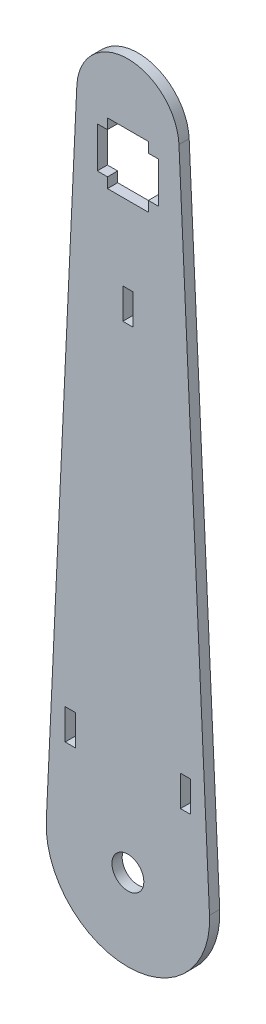
ISO-10303-21;
HEADER;
FILE_DESCRIPTION(('STEP AP214'),'2;1');
FILE_NAME('part.step','',(''),(''),'','','');
FILE_SCHEMA(('AUTOMOTIVE_DESIGN { 1 0 10303 214 1 1 1 1 }'));
ENDSEC;
DATA;
#1=APPLICATION_CONTEXT('core data for automotive mechanical design processes');
#2=APPLICATION_PROTOCOL_DEFINITION('international standard','automotive_design',2000,#1);
#3=PRODUCT_CONTEXT('',#1,'mechanical');
#4=PRODUCT('Part','Part','',(#3));
#5=PRODUCT_RELATED_PRODUCT_CATEGORY('part','',(#4));
#6=PRODUCT_DEFINITION_FORMATION('','',#4);
#7=PRODUCT_DEFINITION_CONTEXT('part definition',#1,'design');
#8=PRODUCT_DEFINITION('design','',#6,#7);
#9=PRODUCT_DEFINITION_SHAPE('','',#8);
#10=(LENGTH_UNIT() NAMED_UNIT(*) SI_UNIT(.MILLI.,.METRE.));
#11=(NAMED_UNIT(*) PLANE_ANGLE_UNIT() SI_UNIT($,.RADIAN.));
#12=(NAMED_UNIT(*) SI_UNIT($,.STERADIAN.) SOLID_ANGLE_UNIT());
#13=UNCERTAINTY_MEASURE_WITH_UNIT(LENGTH_MEASURE(1.E-05),#10,'distance_accuracy_value','');
#14=(GEOMETRIC_REPRESENTATION_CONTEXT(3) GLOBAL_UNCERTAINTY_ASSIGNED_CONTEXT((#13)) GLOBAL_UNIT_ASSIGNED_CONTEXT((#10,
#11,#12)) REPRESENTATION_CONTEXT('',''));
#15=CARTESIAN_POINT('',(0.,0.,0.));
#16=DIRECTION('',(0.,0.,1.));
#17=DIRECTION('',(1.,0.,0.));
#18=AXIS2_PLACEMENT_3D('',#15,#16,#17);
#19=CARTESIAN_POINT('',(0.,0.,3.175));
#20=DIRECTION('',(0.,0.,-1.));
#21=DIRECTION('',(-1.,0.,0.));
#22=AXIS2_PLACEMENT_3D('',#19,#20,#21);
#23=PLANE('',#22);
#24=DIRECTION('',(0.,-1.,0.));
#25=VECTOR('',#24,1.);
#26=CARTESIAN_POINT('',(-6.34999999999992,196.85,3.175));
#27=LINE('',#26,#25);
#28=CARTESIAN_POINT('',(-6.34999999999992,200.025,3.175));
#29=VERTEX_POINT('',#28);
#30=CARTESIAN_POINT('',(-6.34999999999992,196.85,3.175));
#31=VERTEX_POINT('',#30);
#32=EDGE_CURVE('E260',#29,#31,#27,.T.);
#33=ORIENTED_EDGE('',*,*,#32,.F.);
#34=DIRECTION('',(-1.,0.,0.));
#35=VECTOR('',#34,1.);
#36=CARTESIAN_POINT('',(-6.34999999999992,200.025,3.175));
#37=LINE('',#36,#35);
#38=CARTESIAN_POINT('',(6.34999999999982,200.025,3.175));
#39=VERTEX_POINT('',#38);
#40=EDGE_CURVE('E284',#39,#29,#37,.T.);
#41=ORIENTED_EDGE('',*,*,#40,.F.);
#42=DIRECTION('',(0.,1.,0.));
#43=VECTOR('',#42,1.);
#44=CARTESIAN_POINT('',(6.34999999999982,200.025,3.175));
#45=LINE('',#44,#43);
#46=CARTESIAN_POINT('',(6.34999999999982,196.85,3.175));
#47=VERTEX_POINT('',#46);
#48=EDGE_CURVE('E281',#47,#39,#45,.T.);
#49=ORIENTED_EDGE('',*,*,#48,.F.);
#50=DIRECTION('',(-1.,0.,0.));
#51=VECTOR('',#50,1.);
#52=CARTESIAN_POINT('',(6.34999999999982,196.85,3.175));
#53=LINE('',#52,#51);
#54=CARTESIAN_POINT('',(9.52499999999992,196.85,3.175));
#55=VERTEX_POINT('',#54);
#56=EDGE_CURVE('E279',#55,#47,#53,.T.);
#57=ORIENTED_EDGE('',*,*,#56,.F.);
#58=DIRECTION('',(0.,1.,0.));
#59=VECTOR('',#58,1.);
#60=CARTESIAN_POINT('',(9.52499999999992,196.85,3.175));
#61=LINE('',#60,#59);
#62=CARTESIAN_POINT('',(9.52499999999996,184.15,3.175));
#63=VERTEX_POINT('',#62);
#64=EDGE_CURVE('E277',#63,#55,#61,.T.);
#65=ORIENTED_EDGE('',*,*,#64,.F.);
#66=DIRECTION('',(1.,0.,0.));
#67=VECTOR('',#66,1.);
#68=CARTESIAN_POINT('',(9.52499999999996,184.15,3.175));
#69=LINE('',#68,#67);
#70=CARTESIAN_POINT('',(6.34999999999982,184.15,3.175));
#71=VERTEX_POINT('',#70);
#72=EDGE_CURVE('E275',#71,#63,#69,.T.);
#73=ORIENTED_EDGE('',*,*,#72,.F.);
#74=DIRECTION('',(0.,1.,0.));
#75=VECTOR('',#74,1.);
#76=CARTESIAN_POINT('',(6.34999999999982,184.15,3.175));
#77=LINE('',#76,#75);
#78=CARTESIAN_POINT('',(6.34999999999982,180.975,3.175));
#79=VERTEX_POINT('',#78);
#80=EDGE_CURVE('E273',#79,#71,#77,.T.);
#81=ORIENTED_EDGE('',*,*,#80,.F.);
#82=DIRECTION('',(1.,0.,0.));
#83=VECTOR('',#82,1.);
#84=CARTESIAN_POINT('',(6.34999999999982,180.975,3.175));
#85=LINE('',#84,#83);
#86=CARTESIAN_POINT('',(-6.34999999999992,180.975,3.175));
#87=VERTEX_POINT('',#86);
#88=EDGE_CURVE('E271',#87,#79,#85,.T.);
#89=ORIENTED_EDGE('',*,*,#88,.F.);
#90=DIRECTION('',(0.,-1.,0.));
#91=VECTOR('',#90,1.);
#92=CARTESIAN_POINT('',(-6.34999999999992,180.975,3.175));
#93=LINE('',#92,#91);
#94=CARTESIAN_POINT('',(-6.34999999999992,184.15,3.175));
#95=VERTEX_POINT('',#94);
#96=EDGE_CURVE('E269',#95,#87,#93,.T.);
#97=ORIENTED_EDGE('',*,*,#96,.F.);
#98=DIRECTION('',(1.,0.,0.));
#99=VECTOR('',#98,1.);
#100=CARTESIAN_POINT('',(-6.34999999999992,184.15,3.175));
#101=LINE('',#100,#99);
#102=CARTESIAN_POINT('',(-9.52500000000004,184.15,3.175));
#103=VERTEX_POINT('',#102);
#104=EDGE_CURVE('E267',#103,#95,#101,.T.);
#105=ORIENTED_EDGE('',*,*,#104,.F.);
#106=DIRECTION('',(0.,-1.,0.));
#107=VECTOR('',#106,1.);
#108=CARTESIAN_POINT('',(-9.52500000000004,184.15,3.175));
#109=LINE('',#108,#107);
#110=CARTESIAN_POINT('',(-9.52499999999992,196.85,3.175));
#111=VERTEX_POINT('',#110);
#112=EDGE_CURVE('E265',#111,#103,#109,.T.);
#113=ORIENTED_EDGE('',*,*,#112,.F.);
#114=DIRECTION('',(-1.,0.,0.));
#115=VECTOR('',#114,1.);
#116=CARTESIAN_POINT('',(-9.52499999999992,196.85,3.175));
#117=LINE('',#116,#115);
#118=EDGE_CURVE('E262',#31,#111,#117,.T.);
#119=ORIENTED_EDGE('',*,*,#118,.F.);
#120=EDGE_LOOP('',(#33,#41,#49,#57,#65,#73,#81,#89,#97,#105,#113,#119));
#121=FACE_BOUND('',#120,.T.);
#122=DIRECTION('',(0.,-1.,0.));
#123=VECTOR('',#122,1.);
#124=CARTESIAN_POINT('',(-19.5072,34.925,3.175));
#125=LINE('',#124,#123);
#126=CARTESIAN_POINT('',(-19.5072,34.925,3.175));
#127=VERTEX_POINT('',#126);
#128=CARTESIAN_POINT('',(-19.5072,25.4,3.175));
#129=VERTEX_POINT('',#128);
#130=EDGE_CURVE('E378',#127,#129,#125,.T.);
#131=ORIENTED_EDGE('',*,*,#130,.F.);
#132=DIRECTION('',(-1.,0.,0.));
#133=VECTOR('',#132,1.);
#134=CARTESIAN_POINT('',(-19.5072,34.925,3.175));
#135=LINE('',#134,#133);
#136=CARTESIAN_POINT('',(-16.3322,34.925,3.175));
#137=VERTEX_POINT('',#136);
#138=EDGE_CURVE('E386',#137,#127,#135,.T.);
#139=ORIENTED_EDGE('',*,*,#138,.F.);
#140=DIRECTION('',(0.,1.,0.));
#141=VECTOR('',#140,1.);
#142=CARTESIAN_POINT('',(-16.3322,34.925,3.175));
#143=LINE('',#142,#141);
#144=CARTESIAN_POINT('',(-16.3322,25.4,3.175));
#145=VERTEX_POINT('',#144);
#146=EDGE_CURVE('E383',#145,#137,#143,.T.);
#147=ORIENTED_EDGE('',*,*,#146,.F.);
#148=DIRECTION('',(1.,0.,0.));
#149=VECTOR('',#148,1.);
#150=CARTESIAN_POINT('',(-19.5072,25.4,3.175));
#151=LINE('',#150,#149);
#152=EDGE_CURVE('E380',#129,#145,#151,.T.);
#153=ORIENTED_EDGE('',*,*,#152,.F.);
#154=EDGE_LOOP('',(#131,#139,#147,#153));
#155=FACE_BOUND('',#154,.T.);
#156=CARTESIAN_POINT('',(0.,0.,3.175));
#157=DIRECTION('',(0.,0.,1.));
#158=DIRECTION('',(-1.,0.,0.));
#159=AXIS2_PLACEMENT_3D('',#156,#157,#158);
#160=CIRCLE('',#159,25.4);
#161=CARTESIAN_POINT('',(-25.3721813861181,1.18844928790486,3.175));
#162=VERTEX_POINT('',#161);
#163=CARTESIAN_POINT('',(25.3721813861181,1.18844928790486,3.175));
#164=VERTEX_POINT('',#163);
#165=EDGE_CURVE('E415',#162,#164,#160,.T.);
#166=ORIENTED_EDGE('',*,*,#165,.T.);
#167=DIRECTION('',(-0.0467893420434984,0.998904778981028,0.));
#168=VECTOR('',#167,1.);
#169=CARTESIAN_POINT('',(25.3721813861181,1.18844928790486,3.175));
#170=LINE('',#169,#168);
#171=CARTESIAN_POINT('',(15.875,203.94359520604,3.175));
#172=VERTEX_POINT('',#171);
#173=EDGE_CURVE('E418',#164,#172,#170,.T.);
#174=ORIENTED_EDGE('',*,*,#173,.T.);
#175=CARTESIAN_POINT('',(0.,203.2,3.175));
#176=DIRECTION('',(0.,0.,1.));
#177=DIRECTION('',(-1.,0.,0.));
#178=AXIS2_PLACEMENT_3D('',#175,#176,#177);
#179=CIRCLE('',#178,15.8924056967611);
#180=CARTESIAN_POINT('',(-15.875,203.94359520604,3.175));
#181=VERTEX_POINT('',#180);
#182=EDGE_CURVE('E421',#172,#181,#179,.T.);
#183=ORIENTED_EDGE('',*,*,#182,.T.);
#184=DIRECTION('',(-0.0467893420434984,-0.998904778981028,0.));
#185=VECTOR('',#184,1.);
#186=CARTESIAN_POINT('',(-25.3721813861181,1.18844928790486,3.175));
#187=LINE('',#186,#185);
#188=EDGE_CURVE('E423',#181,#162,#187,.T.);
#189=ORIENTED_EDGE('',*,*,#188,.T.);
#190=EDGE_LOOP('',(#166,#174,#183,#189));
#191=FACE_BOUND('',#190,.T.);
#192=CARTESIAN_POINT('',(0.,0.,3.175));
#193=DIRECTION('',(0.,0.,1.));
#194=DIRECTION('',(1.,0.,0.));
#195=AXIS2_PLACEMENT_3D('',#192,#193,#194);
#196=CIRCLE('',#195,4.953);
#197=CARTESIAN_POINT('',(4.953,0.,3.175));
#198=VERTEX_POINT('',#197);
#199=EDGE_CURVE('E409',#198,#198,#196,.T.);
#200=ORIENTED_EDGE('',*,*,#199,.F.);
#201=EDGE_LOOP('',(#200));
#202=FACE_BOUND('',#201,.T.);
#203=DIRECTION('',(0.,1.,0.));
#204=VECTOR('',#203,1.);
#205=CARTESIAN_POINT('',(1.5875,147.6375,3.175));
#206=LINE('',#205,#204);
#207=CARTESIAN_POINT('',(1.5875,147.6375,3.175));
#208=VERTEX_POINT('',#207);
#209=CARTESIAN_POINT('',(1.5875,157.1625,3.175));
#210=VERTEX_POINT('',#209);
#211=EDGE_CURVE('E347',#208,#210,#206,.T.);
#212=ORIENTED_EDGE('',*,*,#211,.F.);
#213=DIRECTION('',(1.,0.,0.));
#214=VECTOR('',#213,1.);
#215=CARTESIAN_POINT('',(-1.5875,147.6375,3.175));
#216=LINE('',#215,#214);
#217=CARTESIAN_POINT('',(-1.5875,147.6375,3.175));
#218=VERTEX_POINT('',#217);
#219=EDGE_CURVE('E355',#218,#208,#216,.T.);
#220=ORIENTED_EDGE('',*,*,#219,.F.);
#221=DIRECTION('',(0.,-1.,0.));
#222=VECTOR('',#221,1.);
#223=CARTESIAN_POINT('',(-1.5875,147.6375,3.175));
#224=LINE('',#223,#222);
#225=CARTESIAN_POINT('',(-1.5875,157.1625,3.175));
#226=VERTEX_POINT('',#225);
#227=EDGE_CURVE('E352',#226,#218,#224,.T.);
#228=ORIENTED_EDGE('',*,*,#227,.F.);
#229=DIRECTION('',(-1.,0.,0.));
#230=VECTOR('',#229,1.);
#231=CARTESIAN_POINT('',(-1.5875,157.1625,3.175));
#232=LINE('',#231,#230);
#233=EDGE_CURVE('E349',#210,#226,#232,.T.);
#234=ORIENTED_EDGE('',*,*,#233,.F.);
#235=EDGE_LOOP('',(#212,#220,#228,#234));
#236=FACE_BOUND('',#235,.T.);
#237=DIRECTION('',(0.,-1.,0.));
#238=VECTOR('',#237,1.);
#239=CARTESIAN_POINT('',(16.3322,25.4,3.175));
#240=LINE('',#239,#238);
#241=CARTESIAN_POINT('',(16.3322,34.925,3.175));
#242=VERTEX_POINT('',#241);
#243=CARTESIAN_POINT('',(16.3322,25.4,3.175));
#244=VERTEX_POINT('',#243);
#245=EDGE_CURVE('E224',#242,#244,#240,.T.);
#246=ORIENTED_EDGE('',*,*,#245,.F.);
#247=DIRECTION('',(-1.,0.,0.));
#248=VECTOR('',#247,1.);
#249=CARTESIAN_POINT('',(16.3322,34.925,3.175));
#250=LINE('',#249,#248);
#251=CARTESIAN_POINT('',(19.5072,34.925,3.175));
#252=VERTEX_POINT('',#251);
#253=EDGE_CURVE('E246',#252,#242,#250,.T.);
#254=ORIENTED_EDGE('',*,*,#253,.F.);
#255=DIRECTION('',(0.,1.,0.));
#256=VECTOR('',#255,1.);
#257=CARTESIAN_POINT('',(19.5072,25.4,3.175));
#258=LINE('',#257,#256);
#259=CARTESIAN_POINT('',(19.5072,25.4,3.175));
#260=VERTEX_POINT('',#259);
#261=EDGE_CURVE('E244',#260,#252,#258,.T.);
#262=ORIENTED_EDGE('',*,*,#261,.F.);
#263=DIRECTION('',(1.,0.,0.));
#264=VECTOR('',#263,1.);
#265=CARTESIAN_POINT('',(16.3322,25.4,3.175));
#266=LINE('',#265,#264);
#267=EDGE_CURVE('E232',#244,#260,#266,.T.);
#268=ORIENTED_EDGE('',*,*,#267,.F.);
#269=EDGE_LOOP('',(#246,#254,#262,#268));
#270=FACE_BOUND('',#269,.T.);
#271=ADVANCED_FACE('F39',(#121,#155,#191,#202,#236,#270),#23,.F.);
#272=CARTESIAN_POINT('',(0.,0.,0.));
#273=DIRECTION('',(0.,0.,-1.));
#274=DIRECTION('',(-1.,0.,0.));
#275=AXIS2_PLACEMENT_3D('',#272,#273,#274);
#276=PLANE('',#275);
#277=CARTESIAN_POINT('',(0.,0.,0.));
#278=DIRECTION('',(0.,0.,1.));
#279=DIRECTION('',(-1.,0.,0.));
#280=AXIS2_PLACEMENT_3D('',#277,#278,#279);
#281=CIRCLE('',#280,25.4);
#282=CARTESIAN_POINT('',(-25.3721813861181,1.18844928790486,0.));
#283=VERTEX_POINT('',#282);
#284=CARTESIAN_POINT('',(25.3721813861181,1.18844928790486,0.));
#285=VERTEX_POINT('',#284);
#286=EDGE_CURVE('E412',#283,#285,#281,.T.);
#287=ORIENTED_EDGE('',*,*,#286,.F.);
#288=DIRECTION('',(-0.0467893420434984,-0.998904778981028,0.));
#289=VECTOR('',#288,1.);
#290=CARTESIAN_POINT('',(-25.3721813861181,1.18844928790486,0.));
#291=LINE('',#290,#289);
#292=CARTESIAN_POINT('',(-15.875,203.94359520604,0.));
#293=VERTEX_POINT('',#292);
#294=EDGE_CURVE('E419',#293,#283,#291,.T.);
#295=ORIENTED_EDGE('',*,*,#294,.F.);
#296=CARTESIAN_POINT('',(0.,203.2,0.));
#297=DIRECTION('',(0.,0.,1.));
#298=DIRECTION('',(-1.,0.,0.));
#299=AXIS2_PLACEMENT_3D('',#296,#297,#298);
#300=CIRCLE('',#299,15.8924056967611);
#301=CARTESIAN_POINT('',(15.875,203.94359520604,0.));
#302=VERTEX_POINT('',#301);
#303=EDGE_CURVE('E430',#302,#293,#300,.T.);
#304=ORIENTED_EDGE('',*,*,#303,.F.);
#305=DIRECTION('',(-0.0467893420434984,0.998904778981028,0.));
#306=VECTOR('',#305,1.);
#307=CARTESIAN_POINT('',(25.3721813861181,1.18844928790486,0.));
#308=LINE('',#307,#306);
#309=EDGE_CURVE('E428',#285,#302,#308,.T.);
#310=ORIENTED_EDGE('',*,*,#309,.F.);
#311=EDGE_LOOP('',(#287,#295,#304,#310));
#312=FACE_BOUND('',#311,.T.);
#313=CARTESIAN_POINT('',(0.,0.,0.));
#314=DIRECTION('',(0.,0.,1.));
#315=DIRECTION('',(1.,0.,0.));
#316=AXIS2_PLACEMENT_3D('',#313,#314,#315);
#317=CIRCLE('',#316,4.953);
#318=CARTESIAN_POINT('',(4.953,0.,0.));
#319=VERTEX_POINT('',#318);
#320=EDGE_CURVE('E408',#319,#319,#317,.T.);
#321=ORIENTED_EDGE('',*,*,#320,.T.);
#322=EDGE_LOOP('',(#321));
#323=FACE_BOUND('',#322,.T.);
#324=DIRECTION('',(-1.,0.,0.));
#325=VECTOR('',#324,1.);
#326=CARTESIAN_POINT('',(-19.5072,34.925,0.));
#327=LINE('',#326,#325);
#328=CARTESIAN_POINT('',(-16.3322,34.925,0.));
#329=VERTEX_POINT('',#328);
#330=CARTESIAN_POINT('',(-19.5072,34.925,0.));
#331=VERTEX_POINT('',#330);
#332=EDGE_CURVE('E381',#329,#331,#327,.T.);
#333=ORIENTED_EDGE('',*,*,#332,.T.);
#334=DIRECTION('',(0.,-1.,0.));
#335=VECTOR('',#334,1.);
#336=CARTESIAN_POINT('',(-19.5072,34.925,0.));
#337=LINE('',#336,#335);
#338=CARTESIAN_POINT('',(-19.5072,25.4,0.));
#339=VERTEX_POINT('',#338);
#340=EDGE_CURVE('E377',#331,#339,#337,.T.);
#341=ORIENTED_EDGE('',*,*,#340,.T.);
#342=DIRECTION('',(1.,0.,0.));
#343=VECTOR('',#342,1.);
#344=CARTESIAN_POINT('',(-19.5072,25.4,0.));
#345=LINE('',#344,#343);
#346=CARTESIAN_POINT('',(-16.3322,25.4,0.));
#347=VERTEX_POINT('',#346);
#348=EDGE_CURVE('E391',#339,#347,#345,.T.);
#349=ORIENTED_EDGE('',*,*,#348,.T.);
#350=DIRECTION('',(0.,1.,0.));
#351=VECTOR('',#350,1.);
#352=CARTESIAN_POINT('',(-16.3322,34.925,0.));
#353=LINE('',#352,#351);
#354=EDGE_CURVE('E394',#347,#329,#353,.T.);
#355=ORIENTED_EDGE('',*,*,#354,.T.);
#356=EDGE_LOOP('',(#333,#341,#349,#355));
#357=FACE_BOUND('',#356,.T.);
#358=DIRECTION('',(1.,0.,0.));
#359=VECTOR('',#358,1.);
#360=CARTESIAN_POINT('',(-1.5875,147.6375,0.));
#361=LINE('',#360,#359);
#362=CARTESIAN_POINT('',(-1.5875,147.6375,0.));
#363=VERTEX_POINT('',#362);
#364=CARTESIAN_POINT('',(1.5875,147.6375,0.));
#365=VERTEX_POINT('',#364);
#366=EDGE_CURVE('E350',#363,#365,#361,.T.);
#367=ORIENTED_EDGE('',*,*,#366,.T.);
#368=DIRECTION('',(0.,1.,0.));
#369=VECTOR('',#368,1.);
#370=CARTESIAN_POINT('',(1.5875,147.6375,0.));
#371=LINE('',#370,#369);
#372=CARTESIAN_POINT('',(1.5875,157.1625,0.));
#373=VERTEX_POINT('',#372);
#374=EDGE_CURVE('E346',#365,#373,#371,.T.);
#375=ORIENTED_EDGE('',*,*,#374,.T.);
#376=DIRECTION('',(-1.,0.,0.));
#377=VECTOR('',#376,1.);
#378=CARTESIAN_POINT('',(-1.5875,157.1625,0.));
#379=LINE('',#378,#377);
#380=CARTESIAN_POINT('',(-1.5875,157.1625,0.));
#381=VERTEX_POINT('',#380);
#382=EDGE_CURVE('E360',#373,#381,#379,.T.);
#383=ORIENTED_EDGE('',*,*,#382,.T.);
#384=DIRECTION('',(0.,-1.,0.));
#385=VECTOR('',#384,1.);
#386=CARTESIAN_POINT('',(-1.5875,147.6375,0.));
#387=LINE('',#386,#385);
#388=EDGE_CURVE('E363',#381,#363,#387,.T.);
#389=ORIENTED_EDGE('',*,*,#388,.T.);
#390=EDGE_LOOP('',(#367,#375,#383,#389));
#391=FACE_BOUND('',#390,.T.);
#392=DIRECTION('',(-1.,0.,0.));
#393=VECTOR('',#392,1.);
#394=CARTESIAN_POINT('',(-6.34999999999992,200.025,0.));
#395=LINE('',#394,#393);
#396=CARTESIAN_POINT('',(6.34999999999982,200.025,0.));
#397=VERTEX_POINT('',#396);
#398=CARTESIAN_POINT('',(-6.34999999999992,200.025,0.));
#399=VERTEX_POINT('',#398);
#400=EDGE_CURVE('E263',#397,#399,#395,.T.);
#401=ORIENTED_EDGE('',*,*,#400,.T.);
#402=DIRECTION('',(0.,-1.,0.));
#403=VECTOR('',#402,1.);
#404=CARTESIAN_POINT('',(-6.34999999999992,196.85,0.));
#405=LINE('',#404,#403);
#406=CARTESIAN_POINT('',(-6.34999999999992,196.85,0.));
#407=VERTEX_POINT('',#406);
#408=EDGE_CURVE('E240',#399,#407,#405,.T.);
#409=ORIENTED_EDGE('',*,*,#408,.T.);
#410=DIRECTION('',(-1.,0.,0.));
#411=VECTOR('',#410,1.);
#412=CARTESIAN_POINT('',(-9.52499999999992,196.85,0.));
#413=LINE('',#412,#411);
#414=CARTESIAN_POINT('',(-9.52499999999992,196.85,0.));
#415=VERTEX_POINT('',#414);
#416=EDGE_CURVE('E289',#407,#415,#413,.T.);
#417=ORIENTED_EDGE('',*,*,#416,.T.);
#418=DIRECTION('',(0.,-1.,0.));
#419=VECTOR('',#418,1.);
#420=CARTESIAN_POINT('',(-9.52500000000004,184.15,0.));
#421=LINE('',#420,#419);
#422=CARTESIAN_POINT('',(-9.52500000000004,184.15,0.));
#423=VERTEX_POINT('',#422);
#424=EDGE_CURVE('E292',#415,#423,#421,.T.);
#425=ORIENTED_EDGE('',*,*,#424,.T.);
#426=DIRECTION('',(1.,0.,0.));
#427=VECTOR('',#426,1.);
#428=CARTESIAN_POINT('',(-6.34999999999992,184.15,0.));
#429=LINE('',#428,#427);
#430=CARTESIAN_POINT('',(-6.34999999999992,184.15,0.));
#431=VERTEX_POINT('',#430);
#432=EDGE_CURVE('E295',#423,#431,#429,.T.);
#433=ORIENTED_EDGE('',*,*,#432,.T.);
#434=DIRECTION('',(0.,-1.,0.));
#435=VECTOR('',#434,1.);
#436=CARTESIAN_POINT('',(-6.34999999999992,180.975,0.));
#437=LINE('',#436,#435);
#438=CARTESIAN_POINT('',(-6.34999999999992,180.975,0.));
#439=VERTEX_POINT('',#438);
#440=EDGE_CURVE('E298',#431,#439,#437,.T.);
#441=ORIENTED_EDGE('',*,*,#440,.T.);
#442=DIRECTION('',(1.,0.,0.));
#443=VECTOR('',#442,1.);
#444=CARTESIAN_POINT('',(6.34999999999982,180.975,0.));
#445=LINE('',#444,#443);
#446=CARTESIAN_POINT('',(6.34999999999982,180.975,0.));
#447=VERTEX_POINT('',#446);
#448=EDGE_CURVE('E301',#439,#447,#445,.T.);
#449=ORIENTED_EDGE('',*,*,#448,.T.);
#450=DIRECTION('',(0.,1.,0.));
#451=VECTOR('',#450,1.);
#452=CARTESIAN_POINT('',(6.34999999999982,184.15,0.));
#453=LINE('',#452,#451);
#454=CARTESIAN_POINT('',(6.34999999999982,184.15,0.));
#455=VERTEX_POINT('',#454);
#456=EDGE_CURVE('E304',#447,#455,#453,.T.);
#457=ORIENTED_EDGE('',*,*,#456,.T.);
#458=DIRECTION('',(1.,0.,0.));
#459=VECTOR('',#458,1.);
#460=CARTESIAN_POINT('',(9.52499999999996,184.15,0.));
#461=LINE('',#460,#459);
#462=CARTESIAN_POINT('',(9.52499999999996,184.15,0.));
#463=VERTEX_POINT('',#462);
#464=EDGE_CURVE('E307',#455,#463,#461,.T.);
#465=ORIENTED_EDGE('',*,*,#464,.T.);
#466=DIRECTION('',(0.,1.,0.));
#467=VECTOR('',#466,1.);
#468=CARTESIAN_POINT('',(9.52499999999992,196.85,0.));
#469=LINE('',#468,#467);
#470=CARTESIAN_POINT('',(9.52499999999992,196.85,0.));
#471=VERTEX_POINT('',#470);
#472=EDGE_CURVE('E310',#463,#471,#469,.T.);
#473=ORIENTED_EDGE('',*,*,#472,.T.);
#474=DIRECTION('',(-1.,0.,0.));
#475=VECTOR('',#474,1.);
#476=CARTESIAN_POINT('',(6.34999999999982,196.85,0.));
#477=LINE('',#476,#475);
#478=CARTESIAN_POINT('',(6.34999999999982,196.85,0.));
#479=VERTEX_POINT('',#478);
#480=EDGE_CURVE('E313',#471,#479,#477,.T.);
#481=ORIENTED_EDGE('',*,*,#480,.T.);
#482=DIRECTION('',(0.,1.,0.));
#483=VECTOR('',#482,1.);
#484=CARTESIAN_POINT('',(6.34999999999982,200.025,0.));
#485=LINE('',#484,#483);
#486=EDGE_CURVE('E316',#479,#397,#485,.T.);
#487=ORIENTED_EDGE('',*,*,#486,.T.);
#488=EDGE_LOOP('',(#401,#409,#417,#425,#433,#441,#449,#457,#465,#473,#481,#487));
#489=FACE_BOUND('',#488,.T.);
#490=DIRECTION('',(-1.,0.,0.));
#491=VECTOR('',#490,1.);
#492=CARTESIAN_POINT('',(16.3322,34.925,0.));
#493=LINE('',#492,#491);
#494=CARTESIAN_POINT('',(19.5072,34.925,0.));
#495=VERTEX_POINT('',#494);
#496=CARTESIAN_POINT('',(16.3322,34.925,0.));
#497=VERTEX_POINT('',#496);
#498=EDGE_CURVE('E233',#495,#497,#493,.T.);
#499=ORIENTED_EDGE('',*,*,#498,.T.);
#500=DIRECTION('',(0.,-1.,0.));
#501=VECTOR('',#500,1.);
#502=CARTESIAN_POINT('',(16.3322,25.4,0.));
#503=LINE('',#502,#501);
#504=CARTESIAN_POINT('',(16.3322,25.4,0.));
#505=VERTEX_POINT('',#504);
#506=EDGE_CURVE('E62',#497,#505,#503,.T.);
#507=ORIENTED_EDGE('',*,*,#506,.T.);
#508=DIRECTION('',(1.,0.,0.));
#509=VECTOR('',#508,1.);
#510=CARTESIAN_POINT('',(16.3322,25.4,0.));
#511=LINE('',#510,#509);
#512=CARTESIAN_POINT('',(19.5072,25.4,0.));
#513=VERTEX_POINT('',#512);
#514=EDGE_CURVE('E239',#505,#513,#511,.T.);
#515=ORIENTED_EDGE('',*,*,#514,.T.);
#516=DIRECTION('',(0.,1.,0.));
#517=VECTOR('',#516,1.);
#518=CARTESIAN_POINT('',(19.5072,25.4,0.));
#519=LINE('',#518,#517);
#520=EDGE_CURVE('E252',#513,#495,#519,.T.);
#521=ORIENTED_EDGE('',*,*,#520,.T.);
#522=EDGE_LOOP('',(#499,#507,#515,#521));
#523=FACE_BOUND('',#522,.T.);
#524=ADVANCED_FACE('F448',(#312,#323,#357,#391,#489,#523),#276,.T.);
#525=CARTESIAN_POINT('',(0.,0.,3.175));
#526=DIRECTION('',(0.,0.,-1.));
#527=DIRECTION('',(-1.,0.,0.));
#528=AXIS2_PLACEMENT_3D('',#525,#526,#527);
#529=CYLINDRICAL_SURFACE('',#528,25.4);
#530=ORIENTED_EDGE('',*,*,#286,.T.);
#531=DIRECTION('',(0.,0.,-1.));
#532=VECTOR('',#531,1.);
#533=CARTESIAN_POINT('',(25.3721813861181,1.18844928790486,3.175));
#534=LINE('',#533,#532);
#535=EDGE_CURVE('E11',#164,#285,#534,.T.);
#536=ORIENTED_EDGE('',*,*,#535,.F.);
#537=ORIENTED_EDGE('',*,*,#165,.F.);
#538=DIRECTION('',(0.,0.,-1.));
#539=VECTOR('',#538,1.);
#540=CARTESIAN_POINT('',(-25.3721813861181,1.18844928790486,3.175));
#541=LINE('',#540,#539);
#542=EDGE_CURVE('E425',#162,#283,#541,.T.);
#543=ORIENTED_EDGE('',*,*,#542,.T.);
#544=EDGE_LOOP('',(#530,#536,#537,#543));
#545=FACE_BOUND('',#544,.T.);
#546=ADVANCED_FACE('F41',(#545),#529,.T.);
#547=CARTESIAN_POINT('',(25.3721813861181,1.18844928790486,3.175));
#548=DIRECTION('',(-0.998904778981028,-0.0467893420434984,0.));
#549=DIRECTION('',(0.0467893420434984,-0.998904778981028,0.));
#550=AXIS2_PLACEMENT_3D('',#547,#548,#549);
#551=PLANE('',#550);
#552=ORIENTED_EDGE('',*,*,#309,.T.);
#553=DIRECTION('',(0.,0.,-1.));
#554=VECTOR('',#553,1.);
#555=CARTESIAN_POINT('',(15.875,203.94359520604,3.175));
#556=LINE('',#555,#554);
#557=EDGE_CURVE('E47',#172,#302,#556,.T.);
#558=ORIENTED_EDGE('',*,*,#557,.F.);
#559=ORIENTED_EDGE('',*,*,#173,.F.);
#560=ORIENTED_EDGE('',*,*,#535,.T.);
#561=EDGE_LOOP('',(#552,#558,#559,#560));
#562=FACE_BOUND('',#561,.T.);
#563=ADVANCED_FACE('F459',(#562),#551,.F.);
#564=CARTESIAN_POINT('',(0.,203.2,3.175));
#565=DIRECTION('',(0.,0.,-1.));
#566=DIRECTION('',(-1.,0.,0.));
#567=AXIS2_PLACEMENT_3D('',#564,#565,#566);
#568=CYLINDRICAL_SURFACE('',#567,15.8924056967611);
#569=ORIENTED_EDGE('',*,*,#303,.T.);
#570=DIRECTION('',(0.,0.,-1.));
#571=VECTOR('',#570,1.);
#572=CARTESIAN_POINT('',(-15.875,203.94359520604,3.175));
#573=LINE('',#572,#571);
#574=EDGE_CURVE('E435',#181,#293,#573,.T.);
#575=ORIENTED_EDGE('',*,*,#574,.F.);
#576=ORIENTED_EDGE('',*,*,#182,.F.);
#577=ORIENTED_EDGE('',*,*,#557,.T.);
#578=EDGE_LOOP('',(#569,#575,#576,#577));
#579=FACE_BOUND('',#578,.T.);
#580=ADVANCED_FACE('F442',(#579),#568,.T.);
#581=CARTESIAN_POINT('',(-25.3721813861181,1.18844928790486,3.175));
#582=DIRECTION('',(0.998904778981028,-0.0467893420434984,0.));
#583=DIRECTION('',(0.0467893420434984,0.998904778981028,0.));
#584=AXIS2_PLACEMENT_3D('',#581,#582,#583);
#585=PLANE('',#584);
#586=ORIENTED_EDGE('',*,*,#294,.T.);
#587=ORIENTED_EDGE('',*,*,#542,.F.);
#588=ORIENTED_EDGE('',*,*,#188,.F.);
#589=ORIENTED_EDGE('',*,*,#574,.T.);
#590=EDGE_LOOP('',(#586,#587,#588,#589));
#591=FACE_BOUND('',#590,.T.);
#592=ADVANCED_FACE('F452',(#591),#585,.F.);
#593=CARTESIAN_POINT('',(0.,0.,3.175));
#594=DIRECTION('',(0.,0.,-1.));
#595=DIRECTION('',(-1.,0.,0.));
#596=AXIS2_PLACEMENT_3D('',#593,#594,#595);
#597=CYLINDRICAL_SURFACE('',#596,4.953);
#598=ORIENTED_EDGE('',*,*,#199,.T.);
#599=EDGE_LOOP('',(#598));
#600=FACE_BOUND('',#599,.T.);
#601=ORIENTED_EDGE('',*,*,#320,.F.);
#602=EDGE_LOOP('',(#601));
#603=FACE_BOUND('',#602,.T.);
#604=ADVANCED_FACE('F476',(#600,#603),#597,.F.);
#605=CARTESIAN_POINT('',(-19.5072,34.925,3.175));
#606=DIRECTION('',(1.,0.,0.));
#607=DIRECTION('',(0.,0.,-1.));
#608=AXIS2_PLACEMENT_3D('',#605,#606,#607);
#609=PLANE('',#608);
#610=ORIENTED_EDGE('',*,*,#340,.F.);
#611=DIRECTION('',(0.,0.,-1.));
#612=VECTOR('',#611,1.);
#613=CARTESIAN_POINT('',(-19.5072,34.925,3.175));
#614=LINE('',#613,#612);
#615=EDGE_CURVE('E388',#127,#331,#614,.T.);
#616=ORIENTED_EDGE('',*,*,#615,.F.);
#617=ORIENTED_EDGE('',*,*,#130,.T.);
#618=DIRECTION('',(0.,0.,-1.));
#619=VECTOR('',#618,1.);
#620=CARTESIAN_POINT('',(-19.5072,25.4,3.175));
#621=LINE('',#620,#619);
#622=EDGE_CURVE('E405',#129,#339,#621,.T.);
#623=ORIENTED_EDGE('',*,*,#622,.T.);
#624=EDGE_LOOP('',(#610,#616,#617,#623));
#625=FACE_BOUND('',#624,.T.);
#626=ADVANCED_FACE('F483',(#625),#609,.T.);
#627=CARTESIAN_POINT('',(-19.5072,25.4,3.175));
#628=DIRECTION('',(0.,1.,0.));
#629=DIRECTION('',(0.,0.,1.));
#630=AXIS2_PLACEMENT_3D('',#627,#628,#629);
#631=PLANE('',#630);
#632=ORIENTED_EDGE('',*,*,#348,.F.);
#633=ORIENTED_EDGE('',*,*,#622,.F.);
#634=ORIENTED_EDGE('',*,*,#152,.T.);
#635=DIRECTION('',(0.,0.,-1.));
#636=VECTOR('',#635,1.);
#637=CARTESIAN_POINT('',(-16.3322,25.4,3.175));
#638=LINE('',#637,#636);
#639=EDGE_CURVE('E403',#145,#347,#638,.T.);
#640=ORIENTED_EDGE('',*,*,#639,.T.);
#641=EDGE_LOOP('',(#632,#633,#634,#640));
#642=FACE_BOUND('',#641,.T.);
#643=ADVANCED_FACE('F488',(#642),#631,.T.);
#644=CARTESIAN_POINT('',(-16.3322,34.925,3.175));
#645=DIRECTION('',(-1.,0.,0.));
#646=DIRECTION('',(0.,-1.,0.));
#647=AXIS2_PLACEMENT_3D('',#644,#645,#646);
#648=PLANE('',#647);
#649=ORIENTED_EDGE('',*,*,#354,.F.);
#650=ORIENTED_EDGE('',*,*,#639,.F.);
#651=ORIENTED_EDGE('',*,*,#146,.T.);
#652=DIRECTION('',(0.,0.,-1.));
#653=VECTOR('',#652,1.);
#654=CARTESIAN_POINT('',(-16.3322,34.925,3.175));
#655=LINE('',#654,#653);
#656=EDGE_CURVE('E401',#137,#329,#655,.T.);
#657=ORIENTED_EDGE('',*,*,#656,.T.);
#658=EDGE_LOOP('',(#649,#650,#651,#657));
#659=FACE_BOUND('',#658,.T.);
#660=ADVANCED_FACE('F582',(#659),#648,.T.);
#661=CARTESIAN_POINT('',(-19.5072,34.925,3.175));
#662=DIRECTION('',(0.,-1.,0.));
#663=DIRECTION('',(0.,0.,-1.));
#664=AXIS2_PLACEMENT_3D('',#661,#662,#663);
#665=PLANE('',#664);
#666=ORIENTED_EDGE('',*,*,#332,.F.);
#667=ORIENTED_EDGE('',*,*,#656,.F.);
#668=ORIENTED_EDGE('',*,*,#138,.T.);
#669=ORIENTED_EDGE('',*,*,#615,.T.);
#670=EDGE_LOOP('',(#666,#667,#668,#669));
#671=FACE_BOUND('',#670,.T.);
#672=ADVANCED_FACE('F578',(#671),#665,.T.);
#673=CARTESIAN_POINT('',(1.5875,147.6375,3.175));
#674=DIRECTION('',(-1.,0.,0.));
#675=DIRECTION('',(0.,0.,1.));
#676=AXIS2_PLACEMENT_3D('',#673,#674,#675);
#677=PLANE('',#676);
#678=ORIENTED_EDGE('',*,*,#374,.F.);
#679=DIRECTION('',(0.,0.,-1.));
#680=VECTOR('',#679,1.);
#681=CARTESIAN_POINT('',(1.5875,147.6375,3.175));
#682=LINE('',#681,#680);
#683=EDGE_CURVE('E357',#208,#365,#682,.T.);
#684=ORIENTED_EDGE('',*,*,#683,.F.);
#685=ORIENTED_EDGE('',*,*,#211,.T.);
#686=DIRECTION('',(0.,0.,-1.));
#687=VECTOR('',#686,1.);
#688=CARTESIAN_POINT('',(1.5875,157.1625,3.175));
#689=LINE('',#688,#687);
#690=EDGE_CURVE('E374',#210,#373,#689,.T.);
#691=ORIENTED_EDGE('',*,*,#690,.T.);
#692=EDGE_LOOP('',(#678,#684,#685,#691));
#693=FACE_BOUND('',#692,.T.);
#694=ADVANCED_FACE('F574',(#693),#677,.T.);
#695=CARTESIAN_POINT('',(-1.5875,157.1625,3.175));
#696=DIRECTION('',(0.,-1.,0.));
#697=DIRECTION('',(0.,0.,-1.));
#698=AXIS2_PLACEMENT_3D('',#695,#696,#697);
#699=PLANE('',#698);
#700=ORIENTED_EDGE('',*,*,#382,.F.);
#701=ORIENTED_EDGE('',*,*,#690,.F.);
#702=ORIENTED_EDGE('',*,*,#233,.T.);
#703=DIRECTION('',(0.,0.,-1.));
#704=VECTOR('',#703,1.);
#705=CARTESIAN_POINT('',(-1.5875,157.1625,3.175));
#706=LINE('',#705,#704);
#707=EDGE_CURVE('E372',#226,#381,#706,.T.);
#708=ORIENTED_EDGE('',*,*,#707,.T.);
#709=EDGE_LOOP('',(#700,#701,#702,#708));
#710=FACE_BOUND('',#709,.T.);
#711=ADVANCED_FACE('F570',(#710),#699,.T.);
#712=CARTESIAN_POINT('',(-1.5875,147.6375,3.175));
#713=DIRECTION('',(1.,0.,0.));
#714=DIRECTION('',(0.,0.,-1.));
#715=AXIS2_PLACEMENT_3D('',#712,#713,#714);
#716=PLANE('',#715);
#717=ORIENTED_EDGE('',*,*,#388,.F.);
#718=ORIENTED_EDGE('',*,*,#707,.F.);
#719=ORIENTED_EDGE('',*,*,#227,.T.);
#720=DIRECTION('',(0.,0.,-1.));
#721=VECTOR('',#720,1.);
#722=CARTESIAN_POINT('',(-1.5875,147.6375,3.175));
#723=LINE('',#722,#721);
#724=EDGE_CURVE('E370',#218,#363,#723,.T.);
#725=ORIENTED_EDGE('',*,*,#724,.T.);
#726=EDGE_LOOP('',(#717,#718,#719,#725));
#727=FACE_BOUND('',#726,.T.);
#728=ADVANCED_FACE('F566',(#727),#716,.T.);
#729=CARTESIAN_POINT('',(-1.5875,147.6375,3.175));
#730=DIRECTION('',(0.,1.,0.));
#731=DIRECTION('',(0.,0.,1.));
#732=AXIS2_PLACEMENT_3D('',#729,#730,#731);
#733=PLANE('',#732);
#734=ORIENTED_EDGE('',*,*,#366,.F.);
#735=ORIENTED_EDGE('',*,*,#724,.F.);
#736=ORIENTED_EDGE('',*,*,#219,.T.);
#737=ORIENTED_EDGE('',*,*,#683,.T.);
#738=EDGE_LOOP('',(#734,#735,#736,#737));
#739=FACE_BOUND('',#738,.T.);
#740=ADVANCED_FACE('F562',(#739),#733,.T.);
#741=CARTESIAN_POINT('',(-6.34999999999992,196.85,3.175));
#742=DIRECTION('',(1.,0.,0.));
#743=DIRECTION('',(0.,1.,0.));
#744=AXIS2_PLACEMENT_3D('',#741,#742,#743);
#745=PLANE('',#744);
#746=ORIENTED_EDGE('',*,*,#408,.F.);
#747=DIRECTION('',(0.,0.,-1.));
#748=VECTOR('',#747,1.);
#749=CARTESIAN_POINT('',(-6.34999999999992,200.025,3.175));
#750=LINE('',#749,#748);
#751=EDGE_CURVE('E286',#29,#399,#750,.T.);
#752=ORIENTED_EDGE('',*,*,#751,.F.);
#753=ORIENTED_EDGE('',*,*,#32,.T.);
#754=DIRECTION('',(0.,0.,-1.));
#755=VECTOR('',#754,1.);
#756=CARTESIAN_POINT('',(-6.34999999999992,196.85,3.175));
#757=LINE('',#756,#755);
#758=EDGE_CURVE('E343',#31,#407,#757,.T.);
#759=ORIENTED_EDGE('',*,*,#758,.T.);
#760=EDGE_LOOP('',(#746,#752,#753,#759));
#761=FACE_BOUND('',#760,.T.);
#762=ADVANCED_FACE('F558',(#761),#745,.T.);
#763=CARTESIAN_POINT('',(-9.52499999999992,196.85,3.175));
#764=DIRECTION('',(0.,-1.,0.));
#765=DIRECTION('',(0.,0.,-1.));
#766=AXIS2_PLACEMENT_3D('',#763,#764,#765);
#767=PLANE('',#766);
#768=ORIENTED_EDGE('',*,*,#416,.F.);
#769=ORIENTED_EDGE('',*,*,#758,.F.);
#770=ORIENTED_EDGE('',*,*,#118,.T.);
#771=DIRECTION('',(0.,0.,-1.));
#772=VECTOR('',#771,1.);
#773=CARTESIAN_POINT('',(-9.52499999999992,196.85,3.175));
#774=LINE('',#773,#772);
#775=EDGE_CURVE('E341',#111,#415,#774,.T.);
#776=ORIENTED_EDGE('',*,*,#775,.T.);
#777=EDGE_LOOP('',(#768,#769,#770,#776));
#778=FACE_BOUND('',#777,.T.);
#779=ADVANCED_FACE('F554',(#778),#767,.T.);
#780=CARTESIAN_POINT('',(-9.52500000000004,184.15,3.175));
#781=DIRECTION('',(1.,0.,0.));
#782=DIRECTION('',(0.,1.,0.));
#783=AXIS2_PLACEMENT_3D('',#780,#781,#782);
#784=PLANE('',#783);
#785=ORIENTED_EDGE('',*,*,#424,.F.);
#786=ORIENTED_EDGE('',*,*,#775,.F.);
#787=ORIENTED_EDGE('',*,*,#112,.T.);
#788=DIRECTION('',(0.,0.,-1.));
#789=VECTOR('',#788,1.);
#790=CARTESIAN_POINT('',(-9.52500000000004,184.15,3.175));
#791=LINE('',#790,#789);
#792=EDGE_CURVE('E339',#103,#423,#791,.T.);
#793=ORIENTED_EDGE('',*,*,#792,.T.);
#794=EDGE_LOOP('',(#785,#786,#787,#793));
#795=FACE_BOUND('',#794,.T.);
#796=ADVANCED_FACE('F550',(#795),#784,.T.);
#797=CARTESIAN_POINT('',(-6.34999999999992,184.15,3.175));
#798=DIRECTION('',(0.,1.,0.));
#799=DIRECTION('',(0.,0.,1.));
#800=AXIS2_PLACEMENT_3D('',#797,#798,#799);
#801=PLANE('',#800);
#802=ORIENTED_EDGE('',*,*,#432,.F.);
#803=ORIENTED_EDGE('',*,*,#792,.F.);
#804=ORIENTED_EDGE('',*,*,#104,.T.);
#805=DIRECTION('',(0.,0.,-1.));
#806=VECTOR('',#805,1.);
#807=CARTESIAN_POINT('',(-6.34999999999992,184.15,3.175));
#808=LINE('',#807,#806);
#809=EDGE_CURVE('E337',#95,#431,#808,.T.);
#810=ORIENTED_EDGE('',*,*,#809,.T.);
#811=EDGE_LOOP('',(#802,#803,#804,#810));
#812=FACE_BOUND('',#811,.T.);
#813=ADVANCED_FACE('F546',(#812),#801,.T.);
#814=CARTESIAN_POINT('',(-6.34999999999992,180.975,3.175));
#815=DIRECTION('',(1.,0.,0.));
#816=DIRECTION('',(0.,1.,0.));
#817=AXIS2_PLACEMENT_3D('',#814,#815,#816);
#818=PLANE('',#817);
#819=ORIENTED_EDGE('',*,*,#440,.F.);
#820=ORIENTED_EDGE('',*,*,#809,.F.);
#821=ORIENTED_EDGE('',*,*,#96,.T.);
#822=DIRECTION('',(0.,0.,-1.));
#823=VECTOR('',#822,1.);
#824=CARTESIAN_POINT('',(-6.34999999999992,180.975,3.175));
#825=LINE('',#824,#823);
#826=EDGE_CURVE('E335',#87,#439,#825,.T.);
#827=ORIENTED_EDGE('',*,*,#826,.T.);
#828=EDGE_LOOP('',(#819,#820,#821,#827));
#829=FACE_BOUND('',#828,.T.);
#830=ADVANCED_FACE('F542',(#829),#818,.T.);
#831=CARTESIAN_POINT('',(6.34999999999982,180.975,3.175));
#832=DIRECTION('',(0.,1.,0.));
#833=DIRECTION('',(0.,0.,1.));
#834=AXIS2_PLACEMENT_3D('',#831,#832,#833);
#835=PLANE('',#834);
#836=ORIENTED_EDGE('',*,*,#448,.F.);
#837=ORIENTED_EDGE('',*,*,#826,.F.);
#838=ORIENTED_EDGE('',*,*,#88,.T.);
#839=DIRECTION('',(0.,0.,-1.));
#840=VECTOR('',#839,1.);
#841=CARTESIAN_POINT('',(6.34999999999982,180.975,3.175));
#842=LINE('',#841,#840);
#843=EDGE_CURVE('E333',#79,#447,#842,.T.);
#844=ORIENTED_EDGE('',*,*,#843,.T.);
#845=EDGE_LOOP('',(#836,#837,#838,#844));
#846=FACE_BOUND('',#845,.T.);
#847=ADVANCED_FACE('F538',(#846),#835,.T.);
#848=CARTESIAN_POINT('',(6.34999999999982,184.15,3.175));
#849=DIRECTION('',(-1.,0.,0.));
#850=DIRECTION('',(0.,-1.,0.));
#851=AXIS2_PLACEMENT_3D('',#848,#849,#850);
#852=PLANE('',#851);
#853=ORIENTED_EDGE('',*,*,#456,.F.);
#854=ORIENTED_EDGE('',*,*,#843,.F.);
#855=ORIENTED_EDGE('',*,*,#80,.T.);
#856=DIRECTION('',(0.,0.,-1.));
#857=VECTOR('',#856,1.);
#858=CARTESIAN_POINT('',(6.34999999999982,184.15,3.175));
#859=LINE('',#858,#857);
#860=EDGE_CURVE('E331',#71,#455,#859,.T.);
#861=ORIENTED_EDGE('',*,*,#860,.T.);
#862=EDGE_LOOP('',(#853,#854,#855,#861));
#863=FACE_BOUND('',#862,.T.);
#864=ADVANCED_FACE('F534',(#863),#852,.T.);
#865=CARTESIAN_POINT('',(9.52499999999996,184.15,3.175));
#866=DIRECTION('',(0.,1.,0.));
#867=DIRECTION('',(-1.,0.,0.));
#868=AXIS2_PLACEMENT_3D('',#865,#866,#867);
#869=PLANE('',#868);
#870=ORIENTED_EDGE('',*,*,#464,.F.);
#871=ORIENTED_EDGE('',*,*,#860,.F.);
#872=ORIENTED_EDGE('',*,*,#72,.T.);
#873=DIRECTION('',(0.,0.,-1.));
#874=VECTOR('',#873,1.);
#875=CARTESIAN_POINT('',(9.52499999999996,184.15,3.175));
#876=LINE('',#875,#874);
#877=EDGE_CURVE('E329',#63,#463,#876,.T.);
#878=ORIENTED_EDGE('',*,*,#877,.T.);
#879=EDGE_LOOP('',(#870,#871,#872,#878));
#880=FACE_BOUND('',#879,.T.);
#881=ADVANCED_FACE('F530',(#880),#869,.T.);
#882=CARTESIAN_POINT('',(9.52499999999992,196.85,3.175));
#883=DIRECTION('',(-1.,0.,0.));
#884=DIRECTION('',(0.,-1.,0.));
#885=AXIS2_PLACEMENT_3D('',#882,#883,#884);
#886=PLANE('',#885);
#887=ORIENTED_EDGE('',*,*,#472,.F.);
#888=ORIENTED_EDGE('',*,*,#877,.F.);
#889=ORIENTED_EDGE('',*,*,#64,.T.);
#890=DIRECTION('',(0.,0.,-1.));
#891=VECTOR('',#890,1.);
#892=CARTESIAN_POINT('',(9.52499999999992,196.85,3.175));
#893=LINE('',#892,#891);
#894=EDGE_CURVE('E327',#55,#471,#893,.T.);
#895=ORIENTED_EDGE('',*,*,#894,.T.);
#896=EDGE_LOOP('',(#887,#888,#889,#895));
#897=FACE_BOUND('',#896,.T.);
#898=ADVANCED_FACE('F526',(#897),#886,.T.);
#899=CARTESIAN_POINT('',(6.34999999999982,196.85,3.175));
#900=DIRECTION('',(0.,-1.,0.));
#901=DIRECTION('',(0.,0.,-1.));
#902=AXIS2_PLACEMENT_3D('',#899,#900,#901);
#903=PLANE('',#902);
#904=ORIENTED_EDGE('',*,*,#480,.F.);
#905=ORIENTED_EDGE('',*,*,#894,.F.);
#906=ORIENTED_EDGE('',*,*,#56,.T.);
#907=DIRECTION('',(0.,0.,-1.));
#908=VECTOR('',#907,1.);
#909=CARTESIAN_POINT('',(6.34999999999982,196.85,3.175));
#910=LINE('',#909,#908);
#911=EDGE_CURVE('E325',#47,#479,#910,.T.);
#912=ORIENTED_EDGE('',*,*,#911,.T.);
#913=EDGE_LOOP('',(#904,#905,#906,#912));
#914=FACE_BOUND('',#913,.T.);
#915=ADVANCED_FACE('F522',(#914),#903,.T.);
#916=CARTESIAN_POINT('',(6.34999999999982,200.025,3.175));
#917=DIRECTION('',(-1.,0.,0.));
#918=DIRECTION('',(0.,0.,1.));
#919=AXIS2_PLACEMENT_3D('',#916,#917,#918);
#920=PLANE('',#919);
#921=ORIENTED_EDGE('',*,*,#486,.F.);
#922=ORIENTED_EDGE('',*,*,#911,.F.);
#923=ORIENTED_EDGE('',*,*,#48,.T.);
#924=DIRECTION('',(0.,0.,-1.));
#925=VECTOR('',#924,1.);
#926=CARTESIAN_POINT('',(6.34999999999982,200.025,3.175));
#927=LINE('',#926,#925);
#928=EDGE_CURVE('E323',#39,#397,#927,.T.);
#929=ORIENTED_EDGE('',*,*,#928,.T.);
#930=EDGE_LOOP('',(#921,#922,#923,#929));
#931=FACE_BOUND('',#930,.T.);
#932=ADVANCED_FACE('F518',(#931),#920,.T.);
#933=CARTESIAN_POINT('',(-6.34999999999992,200.025,3.175));
#934=DIRECTION('',(0.,-1.,0.));
#935=DIRECTION('',(1.,0.,0.));
#936=AXIS2_PLACEMENT_3D('',#933,#934,#935);
#937=PLANE('',#936);
#938=ORIENTED_EDGE('',*,*,#400,.F.);
#939=ORIENTED_EDGE('',*,*,#928,.F.);
#940=ORIENTED_EDGE('',*,*,#40,.T.);
#941=ORIENTED_EDGE('',*,*,#751,.T.);
#942=EDGE_LOOP('',(#938,#939,#940,#941));
#943=FACE_BOUND('',#942,.T.);
#944=ADVANCED_FACE('F515',(#943),#937,.T.);
#945=CARTESIAN_POINT('',(16.3322,25.4,3.175));
#946=DIRECTION('',(1.,0.,0.));
#947=DIRECTION('',(0.,0.,-1.));
#948=AXIS2_PLACEMENT_3D('',#945,#946,#947);
#949=PLANE('',#948);
#950=ORIENTED_EDGE('',*,*,#506,.F.);
#951=DIRECTION('',(0.,0.,-1.));
#952=VECTOR('',#951,1.);
#953=CARTESIAN_POINT('',(16.3322,34.925,3.175));
#954=LINE('',#953,#952);
#955=EDGE_CURVE('E228',#242,#497,#954,.T.);
#956=ORIENTED_EDGE('',*,*,#955,.F.);
#957=ORIENTED_EDGE('',*,*,#245,.T.);
#958=DIRECTION('',(0.,0.,-1.));
#959=VECTOR('',#958,1.);
#960=CARTESIAN_POINT('',(16.3322,25.4,3.175));
#961=LINE('',#960,#959);
#962=EDGE_CURVE('E227',#244,#505,#961,.T.);
#963=ORIENTED_EDGE('',*,*,#962,.T.);
#964=EDGE_LOOP('',(#950,#956,#957,#963));
#965=FACE_BOUND('',#964,.T.);
#966=ADVANCED_FACE('F226',(#965),#949,.T.);
#967=CARTESIAN_POINT('',(16.3322,25.4,3.175));
#968=DIRECTION('',(0.,1.,0.));
#969=DIRECTION('',(0.,0.,1.));
#970=AXIS2_PLACEMENT_3D('',#967,#968,#969);
#971=PLANE('',#970);
#972=ORIENTED_EDGE('',*,*,#514,.F.);
#973=ORIENTED_EDGE('',*,*,#962,.F.);
#974=ORIENTED_EDGE('',*,*,#267,.T.);
#975=DIRECTION('',(0.,0.,-1.));
#976=VECTOR('',#975,1.);
#977=CARTESIAN_POINT('',(19.5072,25.4,3.175));
#978=LINE('',#977,#976);
#979=EDGE_CURVE('E241',#260,#513,#978,.T.);
#980=ORIENTED_EDGE('',*,*,#979,.T.);
#981=EDGE_LOOP('',(#972,#973,#974,#980));
#982=FACE_BOUND('',#981,.T.);
#983=ADVANCED_FACE('F236',(#982),#971,.T.);
#984=CARTESIAN_POINT('',(19.5072,25.4,3.175));
#985=DIRECTION('',(-1.,0.,0.));
#986=DIRECTION('',(0.,0.,1.));
#987=AXIS2_PLACEMENT_3D('',#984,#985,#986);
#988=PLANE('',#987);
#989=ORIENTED_EDGE('',*,*,#520,.F.);
#990=ORIENTED_EDGE('',*,*,#979,.F.);
#991=ORIENTED_EDGE('',*,*,#261,.T.);
#992=DIRECTION('',(0.,0.,-1.));
#993=VECTOR('',#992,1.);
#994=CARTESIAN_POINT('',(19.5072,34.925,3.175));
#995=LINE('',#994,#993);
#996=EDGE_CURVE('E54',#252,#495,#995,.T.);
#997=ORIENTED_EDGE('',*,*,#996,.T.);
#998=EDGE_LOOP('',(#989,#990,#991,#997));
#999=FACE_BOUND('',#998,.T.);
#1000=ADVANCED_FACE('F503',(#999),#988,.T.);
#1001=CARTESIAN_POINT('',(16.3322,34.925,3.175));
#1002=DIRECTION('',(0.,-1.,0.));
#1003=DIRECTION('',(0.,0.,-1.));
#1004=AXIS2_PLACEMENT_3D('',#1001,#1002,#1003);
#1005=PLANE('',#1004);
#1006=ORIENTED_EDGE('',*,*,#498,.F.);
#1007=ORIENTED_EDGE('',*,*,#996,.F.);
#1008=ORIENTED_EDGE('',*,*,#253,.T.);
#1009=ORIENTED_EDGE('',*,*,#955,.T.);
#1010=EDGE_LOOP('',(#1006,#1007,#1008,#1009));
#1011=FACE_BOUND('',#1010,.T.);
#1012=ADVANCED_FACE('F501',(#1011),#1005,.T.);
#1013=CLOSED_SHELL('',(#271,#524,#546,#563,#580,#592,#604,#626,#643,#660,#672,#694,#711,#728,
#740,#762,#779,#796,#813,#830,#847,#864,#881,#898,#915,#932,#944,#966,#983,#1000,#1012));
#1014=MANIFOLD_SOLID_BREP('B2',#1013);
#1015=ADVANCED_BREP_SHAPE_REPRESENTATION('',(#18,#1014),#14);
#1016=SHAPE_DEFINITION_REPRESENTATION(#9,#1015);
ENDSEC;
END-ISO-10303-21;
